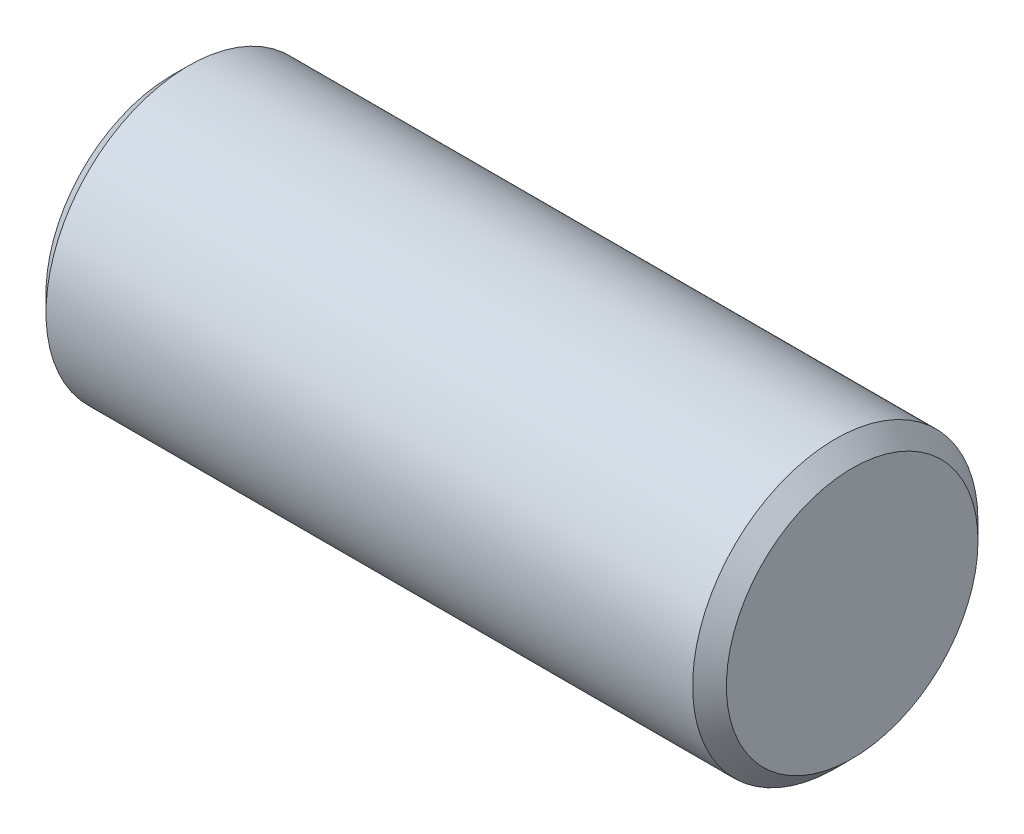
ISO-10303-21;
HEADER;
FILE_DESCRIPTION(('STEP AP214'),'2;1');
FILE_NAME('part.step','',(''),(''),'','','');
FILE_SCHEMA(('AUTOMOTIVE_DESIGN { 1 0 10303 214 1 1 1 1 }'));
ENDSEC;
DATA;
#1=APPLICATION_CONTEXT('core data for automotive mechanical design processes');
#2=APPLICATION_PROTOCOL_DEFINITION('international standard','automotive_design',2000,#1);
#3=PRODUCT_CONTEXT('',#1,'mechanical');
#4=PRODUCT('Part','Part','',(#3));
#5=PRODUCT_RELATED_PRODUCT_CATEGORY('part','',(#4));
#6=PRODUCT_DEFINITION_FORMATION('','',#4);
#7=PRODUCT_DEFINITION_CONTEXT('part definition',#1,'design');
#8=PRODUCT_DEFINITION('design','',#6,#7);
#9=PRODUCT_DEFINITION_SHAPE('','',#8);
#10=(LENGTH_UNIT() NAMED_UNIT(*) SI_UNIT(.MILLI.,.METRE.));
#11=(NAMED_UNIT(*) PLANE_ANGLE_UNIT() SI_UNIT($,.RADIAN.));
#12=(NAMED_UNIT(*) SI_UNIT($,.STERADIAN.) SOLID_ANGLE_UNIT());
#13=UNCERTAINTY_MEASURE_WITH_UNIT(LENGTH_MEASURE(1.E-05),#10,'distance_accuracy_value','');
#14=(GEOMETRIC_REPRESENTATION_CONTEXT(3) GLOBAL_UNCERTAINTY_ASSIGNED_CONTEXT((#13)) GLOBAL_UNIT_ASSIGNED_CONTEXT((#10,
#11,#12)) REPRESENTATION_CONTEXT('',''));
#15=CARTESIAN_POINT('',(0.,0.,0.));
#16=DIRECTION('',(0.,0.,1.));
#17=DIRECTION('',(1.,0.,0.));
#18=AXIS2_PLACEMENT_3D('',#15,#16,#17);
#19=CARTESIAN_POINT('',(82.,0.,0.));
#20=DIRECTION('',(-1.,0.,0.));
#21=DIRECTION('',(0.,0.,1.));
#22=AXIS2_PLACEMENT_3D('',#19,#20,#21);
#23=CYLINDRICAL_SURFACE('',#22,16.9);
#24=CARTESIAN_POINT('',(80.,0.,0.));
#25=DIRECTION('',(1.,0.,0.));
#26=DIRECTION('',(0.,0.,-1.));
#27=AXIS2_PLACEMENT_3D('',#24,#25,#26);
#28=CIRCLE('',#27,16.9);
#29=CARTESIAN_POINT('',(80.,0.,-16.9));
#30=VERTEX_POINT('',#29);
#31=EDGE_CURVE('E43',#30,#30,#28,.F.);
#32=ORIENTED_EDGE('',*,*,#31,.T.);
#33=EDGE_LOOP('',(#32));
#34=FACE_BOUND('',#33,.T.);
#35=CARTESIAN_POINT('',(3.41421356200002,0.,0.));
#36=DIRECTION('',(1.,0.,0.));
#37=DIRECTION('',(0.,0.,-1.));
#38=AXIS2_PLACEMENT_3D('',#35,#36,#37);
#39=CIRCLE('',#38,16.9);
#40=CARTESIAN_POINT('',(3.41421356200002,0.,-16.9));
#41=VERTEX_POINT('',#40);
#42=EDGE_CURVE('E47',#41,#41,#39,.T.);
#43=ORIENTED_EDGE('',*,*,#42,.T.);
#44=EDGE_LOOP('',(#43));
#45=FACE_BOUND('',#44,.T.);
#46=ADVANCED_FACE('F35',(#34,#45),#23,.T.);
#47=CARTESIAN_POINT('',(82.,0.,0.));
#48=DIRECTION('',(1.,0.,0.));
#49=DIRECTION('',(0.,0.,-1.));
#50=AXIS2_PLACEMENT_3D('',#47,#48,#49);
#51=PLANE('',#50);
#52=CARTESIAN_POINT('',(82.,0.,0.));
#53=DIRECTION('',(1.,0.,0.));
#54=DIRECTION('',(0.,0.,-1.));
#55=AXIS2_PLACEMENT_3D('',#52,#53,#54);
#56=CIRCLE('',#55,14.9);
#57=CARTESIAN_POINT('',(82.,0.,-14.9));
#58=VERTEX_POINT('',#57);
#59=EDGE_CURVE('E51',#58,#58,#56,.T.);
#60=ORIENTED_EDGE('',*,*,#59,.T.);
#61=EDGE_LOOP('',(#60));
#62=FACE_BOUND('',#61,.T.);
#63=ADVANCED_FACE('F57',(#62),#51,.T.);
#64=CARTESIAN_POINT('',(1.41421356225,0.,-16.90000000025));
#65=DIRECTION('',(1.,0.,0.));
#66=DIRECTION('',(0.,0.,-1.));
#67=AXIS2_PLACEMENT_3D('',#64,#65,#66);
#68=PLANE('',#67);
#69=CARTESIAN_POINT('',(1.41421356225,0.,0.));
#70=DIRECTION('',(1.,0.,0.));
#71=DIRECTION('',(0.,0.,-1.));
#72=AXIS2_PLACEMENT_3D('',#69,#70,#71);
#73=CIRCLE('',#72,14.90000000025);
#74=CARTESIAN_POINT('',(1.41421356225,0.,-14.90000000025));
#75=VERTEX_POINT('',#74);
#76=EDGE_CURVE('E10',#75,#75,#73,.F.);
#77=ORIENTED_EDGE('',*,*,#76,.T.);
#78=EDGE_LOOP('',(#77));
#79=FACE_BOUND('',#78,.T.);
#80=ADVANCED_FACE('F61',(#79),#68,.F.);
#81=CARTESIAN_POINT('',(82.,0.,0.));
#82=DIRECTION('',(-1.,0.,0.));
#83=DIRECTION('',(0.,0.,1.));
#84=AXIS2_PLACEMENT_3D('',#81,#82,#83);
#85=CONICAL_SURFACE('',#84,14.9,0.785398163397448);
#86=ORIENTED_EDGE('',*,*,#31,.F.);
#87=EDGE_LOOP('',(#86));
#88=FACE_BOUND('',#87,.T.);
#89=ORIENTED_EDGE('',*,*,#59,.F.);
#90=EDGE_LOOP('',(#89));
#91=FACE_BOUND('',#90,.T.);
#92=ADVANCED_FACE('F59',(#88,#91),#85,.T.);
#93=CARTESIAN_POINT('',(3.41421356200002,0.,0.));
#94=DIRECTION('',(1.,0.,0.));
#95=DIRECTION('',(0.,0.,-1.));
#96=AXIS2_PLACEMENT_3D('',#93,#94,#95);
#97=CONICAL_SURFACE('',#96,16.9,0.785398163397448);
#98=ORIENTED_EDGE('',*,*,#76,.F.);
#99=EDGE_LOOP('',(#98));
#100=FACE_BOUND('',#99,.T.);
#101=ORIENTED_EDGE('',*,*,#42,.F.);
#102=EDGE_LOOP('',(#101));
#103=FACE_BOUND('',#102,.T.);
#104=ADVANCED_FACE('F38',(#100,#103),#97,.T.);
#105=CLOSED_SHELL('',(#46,#63,#80,#92,#104));
#106=MANIFOLD_SOLID_BREP('B2',#105);
#107=ADVANCED_BREP_SHAPE_REPRESENTATION('',(#18,#106),#14);
#108=SHAPE_DEFINITION_REPRESENTATION(#9,#107);
ENDSEC;
END-ISO-10303-21;
